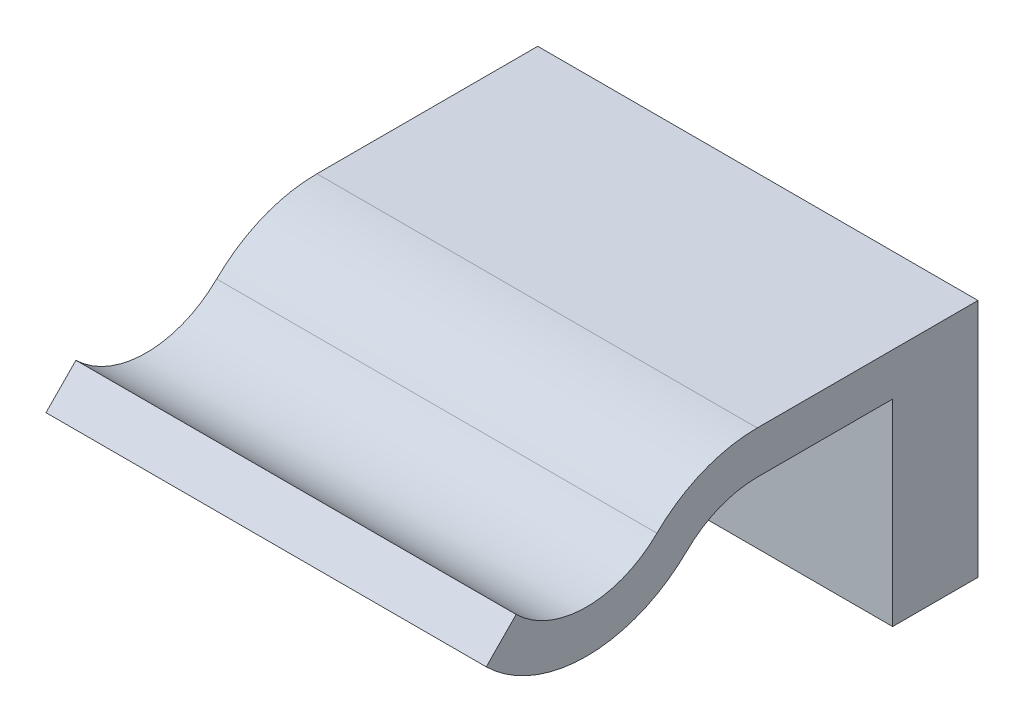
ISO-10303-21;
HEADER;
FILE_DESCRIPTION(('STEP AP214'),'2;1');
FILE_NAME('part.step','',(''),(''),'','','');
FILE_SCHEMA(('AUTOMOTIVE_DESIGN { 1 0 10303 214 1 1 1 1 }'));
ENDSEC;
DATA;
#1=APPLICATION_CONTEXT('core data for automotive mechanical design processes');
#2=APPLICATION_PROTOCOL_DEFINITION('international standard','automotive_design',2000,#1);
#3=PRODUCT_CONTEXT('',#1,'mechanical');
#4=PRODUCT('Part','Part','',(#3));
#5=PRODUCT_RELATED_PRODUCT_CATEGORY('part','',(#4));
#6=PRODUCT_DEFINITION_FORMATION('','',#4);
#7=PRODUCT_DEFINITION_CONTEXT('part definition',#1,'design');
#8=PRODUCT_DEFINITION('design','',#6,#7);
#9=PRODUCT_DEFINITION_SHAPE('','',#8);
#10=(LENGTH_UNIT() NAMED_UNIT(*) SI_UNIT(.MILLI.,.METRE.));
#11=(NAMED_UNIT(*) PLANE_ANGLE_UNIT() SI_UNIT($,.RADIAN.));
#12=(NAMED_UNIT(*) SI_UNIT($,.STERADIAN.) SOLID_ANGLE_UNIT());
#13=UNCERTAINTY_MEASURE_WITH_UNIT(LENGTH_MEASURE(1.E-05),#10,'distance_accuracy_value','');
#14=(GEOMETRIC_REPRESENTATION_CONTEXT(3) GLOBAL_UNCERTAINTY_ASSIGNED_CONTEXT((#13)) GLOBAL_UNIT_ASSIGNED_CONTEXT((#10,
#11,#12)) REPRESENTATION_CONTEXT('',''));
#15=CARTESIAN_POINT('',(0.,0.,0.));
#16=DIRECTION('',(0.,0.,1.));
#17=DIRECTION('',(1.,0.,0.));
#18=AXIS2_PLACEMENT_3D('',#15,#16,#17);
#19=CARTESIAN_POINT('',(-4.1275,-1.7018,0.));
#20=DIRECTION('',(0.,1.,0.));
#21=DIRECTION('',(0.,0.,1.));
#22=AXIS2_PLACEMENT_3D('',#19,#20,#21);
#23=PLANE('',#22);
#24=DIRECTION('',(0.,0.,1.));
#25=VECTOR('',#24,1.);
#26=CARTESIAN_POINT('',(4.1275,-1.7018,0.));
#27=LINE('',#26,#25);
#28=CARTESIAN_POINT('',(4.1275,-1.7018,-1.6));
#29=VERTEX_POINT('',#28);
#30=CARTESIAN_POINT('',(4.1275,-1.7018,0.));
#31=VERTEX_POINT('',#30);
#32=EDGE_CURVE('E253',#29,#31,#27,.T.);
#33=ORIENTED_EDGE('',*,*,#32,.T.);
#34=DIRECTION('',(-1.,0.,0.));
#35=VECTOR('',#34,1.);
#36=CARTESIAN_POINT('',(-4.6355,-1.7018,0.));
#37=LINE('',#36,#35);
#38=CARTESIAN_POINT('',(-4.1275,-1.7018,0.));
#39=VERTEX_POINT('',#38);
#40=EDGE_CURVE('E171',#31,#39,#37,.T.);
#41=ORIENTED_EDGE('',*,*,#40,.T.);
#42=DIRECTION('',(0.,0.,1.));
#43=VECTOR('',#42,1.);
#44=CARTESIAN_POINT('',(-4.1275,-1.7018,0.));
#45=LINE('',#44,#43);
#46=CARTESIAN_POINT('',(-4.1275,-1.7018,-1.6));
#47=VERTEX_POINT('',#46);
#48=EDGE_CURVE('E257',#47,#39,#45,.T.);
#49=ORIENTED_EDGE('',*,*,#48,.F.);
#50=DIRECTION('',(-1.,0.,0.));
#51=VECTOR('',#50,1.);
#52=CARTESIAN_POINT('',(-4.1275,-1.7018,-1.6));
#53=LINE('',#52,#51);
#54=EDGE_CURVE('E178',#29,#47,#53,.T.);
#55=ORIENTED_EDGE('',*,*,#54,.F.);
#56=EDGE_LOOP('',(#33,#41,#49,#55));
#57=FACE_BOUND('',#56,.T.);
#58=ADVANCED_FACE('F163',(#57),#23,.F.);
#59=CARTESIAN_POINT('',(-5.7275,2.7938,-1.6));
#60=DIRECTION('',(0.,1.,0.));
#61=DIRECTION('',(0.,0.,1.));
#62=AXIS2_PLACEMENT_3D('',#59,#60,#61);
#63=PLANE('',#62);
#64=DIRECTION('',(-1.,0.,0.));
#65=VECTOR('',#64,1.);
#66=CARTESIAN_POINT('',(-5.7275,2.7938,-1.6));
#67=LINE('',#66,#65);
#68=CARTESIAN_POINT('',(4.1275,2.7938,-1.6));
#69=VERTEX_POINT('',#68);
#70=CARTESIAN_POINT('',(-4.1275,2.7938,-1.6));
#71=VERTEX_POINT('',#70);
#72=EDGE_CURVE('E52',#69,#71,#67,.T.);
#73=ORIENTED_EDGE('',*,*,#72,.T.);
#74=DIRECTION('',(0.,0.,1.));
#75=VECTOR('',#74,1.);
#76=CARTESIAN_POINT('',(-4.1275,2.7938,0.));
#77=LINE('',#76,#75);
#78=CARTESIAN_POINT('',(-4.1275,2.7938,2.54));
#79=VERTEX_POINT('',#78);
#80=EDGE_CURVE('E290',#71,#79,#77,.T.);
#81=ORIENTED_EDGE('',*,*,#80,.T.);
#82=DIRECTION('',(1.,0.,0.));
#83=VECTOR('',#82,1.);
#84=CARTESIAN_POINT('',(-12.5417041461121,2.7938,2.54));
#85=LINE('',#84,#83);
#86=CARTESIAN_POINT('',(4.1275,2.7938,2.54));
#87=VERTEX_POINT('',#86);
#88=EDGE_CURVE('E249',#79,#87,#85,.T.);
#89=ORIENTED_EDGE('',*,*,#88,.T.);
#90=DIRECTION('',(0.,0.,1.));
#91=VECTOR('',#90,1.);
#92=CARTESIAN_POINT('',(4.1275,2.7938,0.));
#93=LINE('',#92,#91);
#94=EDGE_CURVE('E267',#69,#87,#93,.T.);
#95=ORIENTED_EDGE('',*,*,#94,.F.);
#96=EDGE_LOOP('',(#73,#81,#89,#95));
#97=FACE_BOUND('',#96,.T.);
#98=ADVANCED_FACE('F165',(#97),#63,.T.);
#99=CARTESIAN_POINT('',(0.,0.,-1.6));
#100=DIRECTION('',(0.,0.,1.));
#101=DIRECTION('',(1.,0.,0.));
#102=AXIS2_PLACEMENT_3D('',#99,#100,#101);
#103=PLANE('',#102);
#104=ORIENTED_EDGE('',*,*,#54,.T.);
#105=DIRECTION('',(0.,1.,0.));
#106=VECTOR('',#105,1.);
#107=CARTESIAN_POINT('',(-4.1275,2.7938,-1.6));
#108=LINE('',#107,#106);
#109=EDGE_CURVE('E259',#47,#71,#108,.T.);
#110=ORIENTED_EDGE('',*,*,#109,.T.);
#111=ORIENTED_EDGE('',*,*,#72,.F.);
#112=DIRECTION('',(0.,-1.,0.));
#113=VECTOR('',#112,1.);
#114=CARTESIAN_POINT('',(4.1275,2.7938,-1.6));
#115=LINE('',#114,#113);
#116=EDGE_CURVE('E183',#69,#29,#115,.T.);
#117=ORIENTED_EDGE('',*,*,#116,.T.);
#118=EDGE_LOOP('',(#104,#110,#111,#117));
#119=FACE_BOUND('',#118,.T.);
#120=ADVANCED_FACE('F360',(#119),#103,.F.);
#121=CARTESIAN_POINT('',(0.,0.,0.));
#122=DIRECTION('',(0.,0.,1.));
#123=DIRECTION('',(1.,0.,0.));
#124=AXIS2_PLACEMENT_3D('',#121,#122,#123);
#125=PLANE('',#124);
#126=DIRECTION('',(0.,1.,0.));
#127=VECTOR('',#126,1.);
#128=CARTESIAN_POINT('',(-4.1275,0.,0.));
#129=LINE('',#128,#127);
#130=CARTESIAN_POINT('',(-4.1275,1.9938,0.));
#131=VERTEX_POINT('',#130);
#132=EDGE_CURVE('E245',#39,#131,#129,.T.);
#133=ORIENTED_EDGE('',*,*,#132,.F.);
#134=ORIENTED_EDGE('',*,*,#40,.F.);
#135=DIRECTION('',(0.,-1.,0.));
#136=VECTOR('',#135,1.);
#137=CARTESIAN_POINT('',(4.1275,0.,0.));
#138=LINE('',#137,#136);
#139=CARTESIAN_POINT('',(4.1275,1.9938,0.));
#140=VERTEX_POINT('',#139);
#141=EDGE_CURVE('E242',#140,#31,#138,.T.);
#142=ORIENTED_EDGE('',*,*,#141,.F.);
#143=DIRECTION('',(1.,0.,0.));
#144=VECTOR('',#143,1.);
#145=CARTESIAN_POINT('',(-12.5417041461121,1.9938,0.));
#146=LINE('',#145,#144);
#147=EDGE_CURVE('E294',#131,#140,#146,.T.);
#148=ORIENTED_EDGE('',*,*,#147,.F.);
#149=EDGE_LOOP('',(#133,#134,#142,#148));
#150=FACE_BOUND('',#149,.T.);
#151=ADVANCED_FACE('F241',(#150),#125,.T.);
#152=CARTESIAN_POINT('',(-4.1275,1.7018,7.62));
#153=DIRECTION('',(-1.,0.,0.));
#154=DIRECTION('',(0.,0.,1.));
#155=AXIS2_PLACEMENT_3D('',#152,#153,#154);
#156=PLANE('',#155);
#157=ORIENTED_EDGE('',*,*,#80,.F.);
#158=ORIENTED_EDGE('',*,*,#109,.F.);
#159=ORIENTED_EDGE('',*,*,#48,.T.);
#160=ORIENTED_EDGE('',*,*,#132,.T.);
#161=DIRECTION('',(0.,0.,-1.));
#162=VECTOR('',#161,1.);
#163=CARTESIAN_POINT('',(-4.1275,1.9938,0.));
#164=LINE('',#163,#162);
#165=CARTESIAN_POINT('',(-4.1275,1.9938,2.54));
#166=VERTEX_POINT('',#165);
#167=EDGE_CURVE('E295',#166,#131,#164,.T.);
#168=ORIENTED_EDGE('',*,*,#167,.F.);
#169=CARTESIAN_POINT('',(-4.1275,0.109772811849614,2.54));
#170=DIRECTION('',(-1.,0.,0.));
#171=DIRECTION('',(0.,0.,1.));
#172=AXIS2_PLACEMENT_3D('',#169,#170,#171);
#173=CIRCLE('',#172,1.88402718815039);
#174=CARTESIAN_POINT('',(-4.1275,1.45433453853666,3.85973944732216));
#175=VERTEX_POINT('',#174);
#176=EDGE_CURVE('E299',#175,#166,#173,.T.);
#177=ORIENTED_EDGE('',*,*,#176,.F.);
#178=CARTESIAN_POINT('',(-4.1275,3.36982718815039,5.73986972366108));
#179=DIRECTION('',(-1.,0.,0.));
#180=DIRECTION('',(0.,0.,1.));
#181=AXIS2_PLACEMENT_3D('',#178,#179,#180);
#182=CIRCLE('',#181,2.68402718815039);
#183=CARTESIAN_POINT('',(-4.1275,1.45433453853666,7.62));
#184=VERTEX_POINT('',#183);
#185=EDGE_CURVE('E303',#184,#175,#182,.F.);
#186=ORIENTED_EDGE('',*,*,#185,.F.);
#187=DIRECTION('',(0.,-0.71366365365834,0.700488536270958));
#188=VECTOR('',#187,1.);
#189=CARTESIAN_POINT('',(-4.1275,2.02526546146334,7.05960917098323));
#190=LINE('',#189,#188);
#191=CARTESIAN_POINT('',(-4.1275,2.02526546146334,7.05960917098323));
#192=VERTEX_POINT('',#191);
#193=EDGE_CURVE('E307',#192,#184,#190,.T.);
#194=ORIENTED_EDGE('',*,*,#193,.F.);
#195=CARTESIAN_POINT('',(-4.1275,3.36982718815039,5.73986972366108));
#196=DIRECTION('',(-1.,0.,0.));
#197=DIRECTION('',(0.,0.,1.));
#198=AXIS2_PLACEMENT_3D('',#195,#196,#197);
#199=CIRCLE('',#198,1.88402718815039);
#200=CARTESIAN_POINT('',(-4.1275,2.02526546146334,4.42013027633892));
#201=VERTEX_POINT('',#200);
#202=EDGE_CURVE('E311',#201,#192,#199,.T.);
#203=ORIENTED_EDGE('',*,*,#202,.F.);
#204=CARTESIAN_POINT('',(-4.1275,0.109772811849614,2.54));
#205=DIRECTION('',(-1.,0.,0.));
#206=DIRECTION('',(0.,0.,1.));
#207=AXIS2_PLACEMENT_3D('',#204,#205,#206);
#208=CIRCLE('',#207,2.68402718815039);
#209=EDGE_CURVE('E269',#79,#201,#208,.F.);
#210=ORIENTED_EDGE('',*,*,#209,.F.);
#211=EDGE_LOOP('',(#157,#158,#159,#160,#168,#177,#186,#194,#203,#210));
#212=FACE_BOUND('',#211,.T.);
#213=ADVANCED_FACE('F358',(#212),#156,.T.);
#214=CARTESIAN_POINT('',(-12.5417041461121,0.109772811849614,2.54));
#215=DIRECTION('',(1.,0.,0.));
#216=DIRECTION('',(0.,0.,-1.));
#217=AXIS2_PLACEMENT_3D('',#214,#215,#216);
#218=CYLINDRICAL_SURFACE('',#217,2.68402718815039);
#219=ORIENTED_EDGE('',*,*,#88,.F.);
#220=ORIENTED_EDGE('',*,*,#209,.T.);
#221=DIRECTION('',(1.,0.,0.));
#222=VECTOR('',#221,1.);
#223=CARTESIAN_POINT('',(-12.5417041461121,2.02526546146334,4.42013027633892));
#224=LINE('',#223,#222);
#225=CARTESIAN_POINT('',(4.1275,2.02526546146334,4.42013027633892));
#226=VERTEX_POINT('',#225);
#227=EDGE_CURVE('E289',#201,#226,#224,.T.);
#228=ORIENTED_EDGE('',*,*,#227,.T.);
#229=CARTESIAN_POINT('',(4.1275,0.109772811849614,2.54));
#230=DIRECTION('',(1.,0.,0.));
#231=DIRECTION('',(0.,0.,-1.));
#232=AXIS2_PLACEMENT_3D('',#229,#230,#231);
#233=CIRCLE('',#232,2.68402718815039);
#234=EDGE_CURVE('E281',#87,#226,#233,.T.);
#235=ORIENTED_EDGE('',*,*,#234,.F.);
#236=EDGE_LOOP('',(#219,#220,#228,#235));
#237=FACE_BOUND('',#236,.T.);
#238=ADVANCED_FACE('F324',(#237),#218,.T.);
#239=CARTESIAN_POINT('',(-12.5417041461121,3.36982718815039,5.73986972366108));
#240=DIRECTION('',(1.,0.,0.));
#241=DIRECTION('',(0.,0.,-1.));
#242=AXIS2_PLACEMENT_3D('',#239,#240,#241);
#243=CYLINDRICAL_SURFACE('',#242,1.88402718815039);
#244=ORIENTED_EDGE('',*,*,#227,.F.);
#245=ORIENTED_EDGE('',*,*,#202,.T.);
#246=DIRECTION('',(1.,0.,0.));
#247=VECTOR('',#246,1.);
#248=CARTESIAN_POINT('',(-12.5417041461121,2.02526546146334,7.05960917098323));
#249=LINE('',#248,#247);
#250=CARTESIAN_POINT('',(4.1275,2.02526546146334,7.05960917098323));
#251=VERTEX_POINT('',#250);
#252=EDGE_CURVE('E310',#192,#251,#249,.T.);
#253=ORIENTED_EDGE('',*,*,#252,.T.);
#254=CARTESIAN_POINT('',(4.1275,3.36982718815039,5.73986972366108));
#255=DIRECTION('',(1.,0.,0.));
#256=DIRECTION('',(0.,0.,-1.));
#257=AXIS2_PLACEMENT_3D('',#254,#255,#256);
#258=CIRCLE('',#257,1.88402718815039);
#259=EDGE_CURVE('E278',#226,#251,#258,.F.);
#260=ORIENTED_EDGE('',*,*,#259,.F.);
#261=EDGE_LOOP('',(#244,#245,#253,#260));
#262=FACE_BOUND('',#261,.T.);
#263=ADVANCED_FACE('F342',(#262),#243,.F.);
#264=CARTESIAN_POINT('',(-12.5417041461121,2.02526546146334,7.05960917098323));
#265=DIRECTION('',(0.,0.700488536270958,0.71366365365834));
#266=DIRECTION('',(0.,-0.71366365365834,0.700488536270958));
#267=AXIS2_PLACEMENT_3D('',#264,#265,#266);
#268=PLANE('',#267);
#269=ORIENTED_EDGE('',*,*,#252,.F.);
#270=ORIENTED_EDGE('',*,*,#193,.T.);
#271=DIRECTION('',(1.,0.,0.));
#272=VECTOR('',#271,1.);
#273=CARTESIAN_POINT('',(-12.5417041461121,1.45433453853666,7.62));
#274=LINE('',#273,#272);
#275=CARTESIAN_POINT('',(4.1275,1.45433453853666,7.62));
#276=VERTEX_POINT('',#275);
#277=EDGE_CURVE('E306',#184,#276,#274,.T.);
#278=ORIENTED_EDGE('',*,*,#277,.T.);
#279=DIRECTION('',(0.,-0.71366365365834,0.700488536270958));
#280=VECTOR('',#279,1.);
#281=CARTESIAN_POINT('',(4.1275,2.02526546146334,7.05960917098323));
#282=LINE('',#281,#280);
#283=EDGE_CURVE('E275',#251,#276,#282,.T.);
#284=ORIENTED_EDGE('',*,*,#283,.F.);
#285=EDGE_LOOP('',(#269,#270,#278,#284));
#286=FACE_BOUND('',#285,.T.);
#287=ADVANCED_FACE('F345',(#286),#268,.T.);
#288=CARTESIAN_POINT('',(-12.5417041461121,3.36982718815039,5.73986972366108));
#289=DIRECTION('',(1.,0.,0.));
#290=DIRECTION('',(0.,0.,-1.));
#291=AXIS2_PLACEMENT_3D('',#288,#289,#290);
#292=CYLINDRICAL_SURFACE('',#291,2.68402718815039);
#293=ORIENTED_EDGE('',*,*,#277,.F.);
#294=ORIENTED_EDGE('',*,*,#185,.T.);
#295=DIRECTION('',(1.,0.,0.));
#296=VECTOR('',#295,1.);
#297=CARTESIAN_POINT('',(-12.5417041461121,1.45433453853666,3.85973944732216));
#298=LINE('',#297,#296);
#299=CARTESIAN_POINT('',(4.1275,1.45433453853666,3.85973944732216));
#300=VERTEX_POINT('',#299);
#301=EDGE_CURVE('E302',#175,#300,#298,.T.);
#302=ORIENTED_EDGE('',*,*,#301,.T.);
#303=CARTESIAN_POINT('',(4.1275,3.36982718815039,5.73986972366108));
#304=DIRECTION('',(1.,0.,0.));
#305=DIRECTION('',(0.,0.,-1.));
#306=AXIS2_PLACEMENT_3D('',#303,#304,#305);
#307=CIRCLE('',#306,2.68402718815039);
#308=EDGE_CURVE('E272',#276,#300,#307,.T.);
#309=ORIENTED_EDGE('',*,*,#308,.F.);
#310=EDGE_LOOP('',(#293,#294,#302,#309));
#311=FACE_BOUND('',#310,.T.);
#312=ADVANCED_FACE('F349',(#311),#292,.T.);
#313=CARTESIAN_POINT('',(-12.5417041461121,0.109772811849614,2.54));
#314=DIRECTION('',(1.,0.,0.));
#315=DIRECTION('',(0.,0.,-1.));
#316=AXIS2_PLACEMENT_3D('',#313,#314,#315);
#317=CYLINDRICAL_SURFACE('',#316,1.88402718815039);
#318=ORIENTED_EDGE('',*,*,#301,.F.);
#319=ORIENTED_EDGE('',*,*,#176,.T.);
#320=DIRECTION('',(1.,0.,0.));
#321=VECTOR('',#320,1.);
#322=CARTESIAN_POINT('',(-12.5417041461121,1.9938,2.54));
#323=LINE('',#322,#321);
#324=CARTESIAN_POINT('',(4.1275,1.9938,2.54));
#325=VERTEX_POINT('',#324);
#326=EDGE_CURVE('E298',#166,#325,#323,.T.);
#327=ORIENTED_EDGE('',*,*,#326,.T.);
#328=CARTESIAN_POINT('',(4.1275,0.109772811849614,2.54));
#329=DIRECTION('',(1.,0.,0.));
#330=DIRECTION('',(0.,0.,-1.));
#331=AXIS2_PLACEMENT_3D('',#328,#329,#330);
#332=CIRCLE('',#331,1.88402718815039);
#333=EDGE_CURVE('E270',#300,#325,#332,.F.);
#334=ORIENTED_EDGE('',*,*,#333,.F.);
#335=EDGE_LOOP('',(#318,#319,#327,#334));
#336=FACE_BOUND('',#335,.T.);
#337=ADVANCED_FACE('F353',(#336),#317,.F.);
#338=CARTESIAN_POINT('',(-12.5417041461121,1.9938,0.));
#339=DIRECTION('',(0.,-1.,0.));
#340=DIRECTION('',(0.,0.,-1.));
#341=AXIS2_PLACEMENT_3D('',#338,#339,#340);
#342=PLANE('',#341);
#343=ORIENTED_EDGE('',*,*,#326,.F.);
#344=ORIENTED_EDGE('',*,*,#167,.T.);
#345=ORIENTED_EDGE('',*,*,#147,.T.);
#346=DIRECTION('',(0.,0.,-1.));
#347=VECTOR('',#346,1.);
#348=CARTESIAN_POINT('',(4.1275,1.9938,0.));
#349=LINE('',#348,#347);
#350=EDGE_CURVE('E256',#325,#140,#349,.T.);
#351=ORIENTED_EDGE('',*,*,#350,.F.);
#352=EDGE_LOOP('',(#343,#344,#345,#351));
#353=FACE_BOUND('',#352,.T.);
#354=ADVANCED_FACE('F356',(#353),#342,.T.);
#355=CARTESIAN_POINT('',(4.1275,-1.7018,7.62));
#356=DIRECTION('',(1.,0.,0.));
#357=DIRECTION('',(0.,0.,-1.));
#358=AXIS2_PLACEMENT_3D('',#355,#356,#357);
#359=PLANE('',#358);
#360=ORIENTED_EDGE('',*,*,#350,.T.);
#361=ORIENTED_EDGE('',*,*,#141,.T.);
#362=ORIENTED_EDGE('',*,*,#32,.F.);
#363=ORIENTED_EDGE('',*,*,#116,.F.);
#364=ORIENTED_EDGE('',*,*,#94,.T.);
#365=ORIENTED_EDGE('',*,*,#234,.T.);
#366=ORIENTED_EDGE('',*,*,#259,.T.);
#367=ORIENTED_EDGE('',*,*,#283,.T.);
#368=ORIENTED_EDGE('',*,*,#308,.T.);
#369=ORIENTED_EDGE('',*,*,#333,.T.);
#370=EDGE_LOOP('',(#360,#361,#362,#363,#364,#365,#366,#367,#368,#369));
#371=FACE_BOUND('',#370,.T.);
#372=ADVANCED_FACE('F252',(#371),#359,.T.);
#373=CLOSED_SHELL('',(#58,#98,#120,#151,#213,#238,#263,#287,#312,#337,#354,#372));
#374=MANIFOLD_SOLID_BREP('B7',#373);
#375=ADVANCED_BREP_SHAPE_REPRESENTATION('',(#18,#374),#14);
#376=SHAPE_DEFINITION_REPRESENTATION(#9,#375);
ENDSEC;
END-ISO-10303-21;
